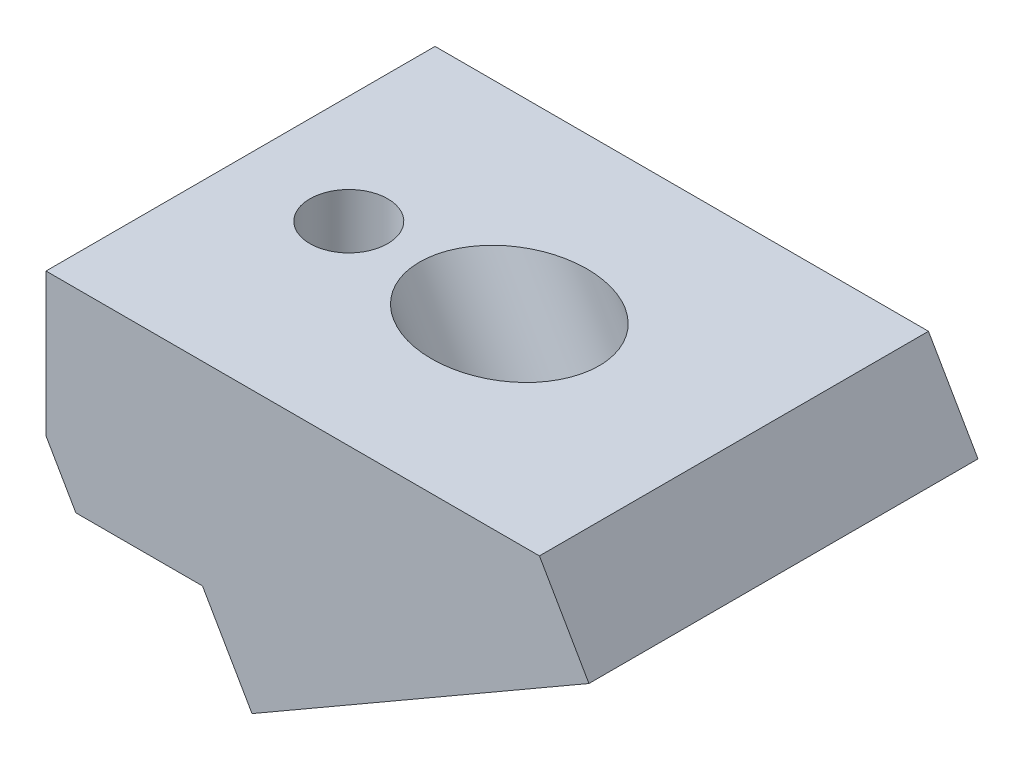
ISO-10303-21;
HEADER;
FILE_DESCRIPTION(('STEP AP214'),'2;1');
FILE_NAME('part.step','',(''),(''),'','','');
FILE_SCHEMA(('AUTOMOTIVE_DESIGN { 1 0 10303 214 1 1 1 1 }'));
ENDSEC;
DATA;
#1=APPLICATION_CONTEXT('core data for automotive mechanical design processes');
#2=APPLICATION_PROTOCOL_DEFINITION('international standard','automotive_design',2000,#1);
#3=PRODUCT_CONTEXT('',#1,'mechanical');
#4=PRODUCT('Part','Part','',(#3));
#5=PRODUCT_RELATED_PRODUCT_CATEGORY('part','',(#4));
#6=PRODUCT_DEFINITION_FORMATION('','',#4);
#7=PRODUCT_DEFINITION_CONTEXT('part definition',#1,'design');
#8=PRODUCT_DEFINITION('design','',#6,#7);
#9=PRODUCT_DEFINITION_SHAPE('','',#8);
#10=(LENGTH_UNIT() NAMED_UNIT(*) SI_UNIT(.MILLI.,.METRE.));
#11=(NAMED_UNIT(*) PLANE_ANGLE_UNIT() SI_UNIT($,.RADIAN.));
#12=(NAMED_UNIT(*) SI_UNIT($,.STERADIAN.) SOLID_ANGLE_UNIT());
#13=UNCERTAINTY_MEASURE_WITH_UNIT(LENGTH_MEASURE(1.E-05),#10,'distance_accuracy_value','');
#14=(GEOMETRIC_REPRESENTATION_CONTEXT(3) GLOBAL_UNCERTAINTY_ASSIGNED_CONTEXT((#13)) GLOBAL_UNIT_ASSIGNED_CONTEXT((#10,
#11,#12)) REPRESENTATION_CONTEXT('',''));
#15=CARTESIAN_POINT('',(0.,0.,0.));
#16=DIRECTION('',(0.,0.,1.));
#17=DIRECTION('',(1.,0.,0.));
#18=AXIS2_PLACEMENT_3D('',#15,#16,#17);
#19=CARTESIAN_POINT('',(-22.8522453423619,18.2415040378444,15.));
#20=DIRECTION('',(-0.866025403784438,-0.500000000000002,0.));
#21=DIRECTION('',(0.500000000000002,-0.866025403784438,0.));
#22=AXIS2_PLACEMENT_3D('',#19,#20,#21);
#23=PLANE('',#22);
#24=DIRECTION('',(0.,0.,-1.));
#25=VECTOR('',#24,1.);
#26=CARTESIAN_POINT('',(-16.8094064186381,7.775,15.));
#27=LINE('',#26,#25);
#28=CARTESIAN_POINT('',(-16.8094064186381,7.775,14.9999999999999));
#29=VERTEX_POINT('',#28);
#30=CARTESIAN_POINT('',(-16.8094064186381,7.775,3.84699737614439));
#31=VERTEX_POINT('',#30);
#32=EDGE_CURVE('E182',#29,#31,#27,.T.);
#33=ORIENTED_EDGE('',*,*,#32,.T.);
#34=CARTESIAN_POINT('',(-20.527350902883,14.2146687464325,0.));
#35=DIRECTION('',(-0.866025403784438,-0.500000000000002,0.));
#36=DIRECTION('',(-0.500000000000002,0.866025403784438,0.));
#37=AXIS2_PLACEMENT_3D('',#34,#35,#36);
#38=ELLIPSE('',#37,10.6999999999978,5.34999999999893);
#39=CARTESIAN_POINT('',(-16.8094064186381,7.775,-3.84699737614439));
#40=VERTEX_POINT('',#39);
#41=EDGE_CURVE('E63',#31,#40,#38,.F.);
#42=ORIENTED_EDGE('',*,*,#41,.T.);
#43=CARTESIAN_POINT('',(-16.8094064186381,7.775,-15.0000000000003));
#44=VERTEX_POINT('',#43);
#45=EDGE_CURVE('E177',#40,#44,#27,.T.);
#46=ORIENTED_EDGE('',*,*,#45,.T.);
#47=DIRECTION('',(0.500000000000002,-0.866025403784438,0.));
#48=VECTOR('',#47,1.);
#49=CARTESIAN_POINT('',(-22.8522453423619,18.2415040378444,-15.));
#50=LINE('',#49,#48);
#51=CARTESIAN_POINT('',(-12.9903810567666,1.16025403784439,-15.));
#52=VERTEX_POINT('',#51);
#53=EDGE_CURVE('E160',#44,#52,#50,.T.);
#54=ORIENTED_EDGE('',*,*,#53,.T.);
#55=DIRECTION('',(0.,0.,-1.));
#56=VECTOR('',#55,1.);
#57=CARTESIAN_POINT('',(-12.9903810567666,1.16025403784439,15.));
#58=LINE('',#57,#56);
#59=CARTESIAN_POINT('',(-12.9903810567666,1.16025403784439,15.));
#60=VERTEX_POINT('',#59);
#61=EDGE_CURVE('E152',#60,#52,#58,.T.);
#62=ORIENTED_EDGE('',*,*,#61,.F.);
#63=DIRECTION('',(0.500000000000002,-0.866025403784438,0.));
#64=VECTOR('',#63,1.);
#65=CARTESIAN_POINT('',(-22.8522453423619,18.2415040378444,15.));
#66=LINE('',#65,#64);
#67=EDGE_CURVE('E162',#29,#60,#66,.T.);
#68=ORIENTED_EDGE('',*,*,#67,.F.);
#69=EDGE_LOOP('',(#33,#42,#46,#54,#62,#68));
#70=FACE_BOUND('',#69,.T.);
#71=ADVANCED_FACE('F42',(#70),#23,.T.);
#72=CARTESIAN_POINT('',(-15.,22.775,-15.));
#73=DIRECTION('',(0.,0.,1.));
#74=DIRECTION('',(1.,0.,0.));
#75=AXIS2_PLACEMENT_3D('',#72,#73,#74);
#76=PLANE('',#75);
#77=DIRECTION('',(-1.,0.,0.));
#78=VECTOR('',#77,1.);
#79=CARTESIAN_POINT('',(-15.4696604564826,7.775,-15.0000000000003));
#80=LINE('',#79,#78);
#81=CARTESIAN_POINT('',(-26.5754872682399,7.775,-15.));
#82=VERTEX_POINT('',#81);
#83=EDGE_CURVE('E118',#44,#82,#80,.T.);
#84=ORIENTED_EDGE('',*,*,#83,.T.);
#85=DIRECTION('',(0.5,-0.866025403784439,0.));
#86=VECTOR('',#85,1.);
#87=CARTESIAN_POINT('',(-38.6554505439858,28.6981101471581,-15.));
#88=LINE('',#87,#86);
#89=CARTESIAN_POINT('',(-28.8773509028816,11.7619447672947,-15.));
#90=VERTEX_POINT('',#89);
#91=EDGE_CURVE('E105',#90,#82,#88,.T.);
#92=ORIENTED_EDGE('',*,*,#91,.F.);
#93=DIRECTION('',(0.,-1.,0.));
#94=VECTOR('',#93,1.);
#95=CARTESIAN_POINT('',(-28.8773509028816,31.275,-15.0000000000003));
#96=LINE('',#95,#94);
#97=CARTESIAN_POINT('',(-28.8773509028816,22.775,-15.0000000000003));
#98=VERTEX_POINT('',#97);
#99=EDGE_CURVE('E114',#98,#90,#96,.T.);
#100=ORIENTED_EDGE('',*,*,#99,.F.);
#101=DIRECTION('',(-1.,0.,0.));
#102=VECTOR('',#101,1.);
#103=CARTESIAN_POINT('',(-15.,22.775,-15.));
#104=LINE('',#103,#102);
#105=CARTESIAN_POINT('',(9.17135569489502,22.775,-15.));
#106=VERTEX_POINT('',#105);
#107=EDGE_CURVE('E171',#106,#98,#104,.T.);
#108=ORIENTED_EDGE('',*,*,#107,.F.);
#109=DIRECTION('',(0.500000000000002,-0.866025403784438,0.));
#110=VECTOR('',#109,1.);
#111=CARTESIAN_POINT('',(3.12851677117123,33.2415040378444,-15.));
#112=LINE('',#111,#110);
#113=CARTESIAN_POINT('',(12.9903810567665,16.1602540378444,-15.));
#114=VERTEX_POINT('',#113);
#115=EDGE_CURVE('E156',#106,#114,#112,.T.);
#116=ORIENTED_EDGE('',*,*,#115,.T.);
#117=DIRECTION('',(-0.866025403784438,-0.500000000000001,0.));
#118=VECTOR('',#117,1.);
#119=CARTESIAN_POINT('',(-15.,0.,-15.));
#120=LINE('',#119,#118);
#121=EDGE_CURVE('E168',#114,#52,#120,.T.);
#122=ORIENTED_EDGE('',*,*,#121,.T.);
#123=ORIENTED_EDGE('',*,*,#53,.F.);
#124=EDGE_LOOP('',(#84,#92,#100,#108,#116,#122,#123));
#125=FACE_BOUND('',#124,.T.);
#126=ADVANCED_FACE('F44',(#125),#76,.F.);
#127=CARTESIAN_POINT('',(-15.,22.775,15.));
#128=DIRECTION('',(0.,0.,-1.));
#129=DIRECTION('',(-1.,0.,0.));
#130=AXIS2_PLACEMENT_3D('',#127,#128,#129);
#131=PLANE('',#130);
#132=DIRECTION('',(0.,-1.,0.));
#133=VECTOR('',#132,1.);
#134=CARTESIAN_POINT('',(-28.8773509028816,31.275,15.));
#135=LINE('',#134,#133);
#136=CARTESIAN_POINT('',(-28.8773509028816,22.775,15.));
#137=VERTEX_POINT('',#136);
#138=CARTESIAN_POINT('',(-28.8773509028816,11.7619447672947,15.));
#139=VERTEX_POINT('',#138);
#140=EDGE_CURVE('E124',#137,#139,#135,.T.);
#141=ORIENTED_EDGE('',*,*,#140,.T.);
#142=DIRECTION('',(-0.5,0.866025403784439,0.));
#143=VECTOR('',#142,1.);
#144=CARTESIAN_POINT('',(-38.6554505439858,28.6981101471581,15.));
#145=LINE('',#144,#143);
#146=CARTESIAN_POINT('',(-26.5754872682399,7.775,15.));
#147=VERTEX_POINT('',#146);
#148=EDGE_CURVE('E57',#147,#139,#145,.T.);
#149=ORIENTED_EDGE('',*,*,#148,.F.);
#150=DIRECTION('',(-1.,0.,0.));
#151=VECTOR('',#150,1.);
#152=CARTESIAN_POINT('',(-15.4696604564825,7.775,14.9999999999998));
#153=LINE('',#152,#151);
#154=EDGE_CURVE('E138',#29,#147,#153,.T.);
#155=ORIENTED_EDGE('',*,*,#154,.F.);
#156=ORIENTED_EDGE('',*,*,#67,.T.);
#157=DIRECTION('',(-0.866025403784438,-0.500000000000001,0.));
#158=VECTOR('',#157,1.);
#159=CARTESIAN_POINT('',(-15.,0.,15.));
#160=LINE('',#159,#158);
#161=CARTESIAN_POINT('',(12.9903810567665,16.1602540378444,15.));
#162=VERTEX_POINT('',#161);
#163=EDGE_CURVE('E167',#162,#60,#160,.T.);
#164=ORIENTED_EDGE('',*,*,#163,.F.);
#165=DIRECTION('',(0.500000000000002,-0.866025403784438,0.));
#166=VECTOR('',#165,1.);
#167=CARTESIAN_POINT('',(3.12851677117123,33.2415040378444,15.));
#168=LINE('',#167,#166);
#169=CARTESIAN_POINT('',(9.17135569489502,22.775,15.));
#170=VERTEX_POINT('',#169);
#171=EDGE_CURVE('E155',#170,#162,#168,.T.);
#172=ORIENTED_EDGE('',*,*,#171,.F.);
#173=DIRECTION('',(1.,0.,0.));
#174=VECTOR('',#173,1.);
#175=CARTESIAN_POINT('',(-15.,22.775,15.));
#176=LINE('',#175,#174);
#177=EDGE_CURVE('E175',#137,#170,#176,.T.);
#178=ORIENTED_EDGE('',*,*,#177,.F.);
#179=EDGE_LOOP('',(#141,#149,#155,#156,#164,#172,#178));
#180=FACE_BOUND('',#179,.T.);
#181=ADVANCED_FACE('F198',(#180),#131,.F.);
#182=CARTESIAN_POINT('',(0.,22.775,0.));
#183=DIRECTION('',(0.,-1.,0.));
#184=DIRECTION('',(0.,0.,-1.));
#185=AXIS2_PLACEMENT_3D('',#182,#183,#184);
#186=PLANE('',#185);
#187=CARTESIAN_POINT('',(-8.14914767260905,22.775,4.07721530149008E-06));
#188=DIRECTION('',(0.,-1.,0.));
#189=DIRECTION('',(1.,0.,0.));
#190=AXIS2_PLACEMENT_3D('',#187,#188,#189);
#191=ELLIPSE('',#190,6.92820323027552,6.);
#192=CARTESIAN_POINT('',(-1.22094444233353,22.775,4.07721530149008E-06));
#193=VERTEX_POINT('',#192);
#194=EDGE_CURVE('E149',#193,#193,#191,.T.);
#195=ORIENTED_EDGE('',*,*,#194,.T.);
#196=EDGE_LOOP('',(#195));
#197=FACE_BOUND('',#196,.T.);
#198=ORIENTED_EDGE('',*,*,#107,.T.);
#199=DIRECTION('',(0.,0.,1.));
#200=VECTOR('',#199,1.);
#201=CARTESIAN_POINT('',(-28.8773509028816,22.775,0.));
#202=LINE('',#201,#200);
#203=EDGE_CURVE('E123',#98,#137,#202,.T.);
#204=ORIENTED_EDGE('',*,*,#203,.T.);
#205=ORIENTED_EDGE('',*,*,#177,.T.);
#206=DIRECTION('',(0.,0.,1.));
#207=VECTOR('',#206,1.);
#208=CARTESIAN_POINT('',(9.17135569489502,22.775,0.));
#209=LINE('',#208,#207);
#210=EDGE_CURVE('E159',#106,#170,#209,.T.);
#211=ORIENTED_EDGE('',*,*,#210,.F.);
#212=EDGE_LOOP('',(#198,#204,#205,#211));
#213=FACE_BOUND('',#212,.T.);
#214=CARTESIAN_POINT('',(-20.527350902883,22.775,0.));
#215=DIRECTION('',(0.,-1.,0.));
#216=DIRECTION('',(0.,0.,-1.));
#217=AXIS2_PLACEMENT_3D('',#214,#215,#216);
#218=CIRCLE('',#217,2.99999999999893);
#219=CARTESIAN_POINT('',(-20.527350902883,22.775,-2.99999999999893));
#220=VERTEX_POINT('',#219);
#221=EDGE_CURVE('E125',#220,#220,#218,.F.);
#222=ORIENTED_EDGE('',*,*,#221,.F.);
#223=EDGE_LOOP('',(#222));
#224=FACE_BOUND('',#223,.T.);
#225=ADVANCED_FACE('F239',(#197,#213,#224),#186,.F.);
#226=CARTESIAN_POINT('',(-15.,0.,-15.));
#227=DIRECTION('',(-0.500000000000001,0.866025403784438,0.));
#228=DIRECTION('',(-0.866025403784438,-0.500000000000001,0.));
#229=AXIS2_PLACEMENT_3D('',#226,#227,#228);
#230=PLANE('',#229);
#231=CARTESIAN_POINT('',(3.53113851526976E-06,8.66025607654819,4.07721530149008E-06));
#232=DIRECTION('',(0.500000000000001,-0.866025403784438,0.));
#233=DIRECTION('',(0.866025403784438,0.500000000000001,0.));
#234=AXIS2_PLACEMENT_3D('',#231,#232,#233);
#235=CIRCLE('',#234,3.95);
#236=CARTESIAN_POINT('',(3.42080387608705,10.6352560765482,4.07721530149008E-06));
#237=VERTEX_POINT('',#236);
#238=EDGE_CURVE('E145',#237,#237,#235,.T.);
#239=ORIENTED_EDGE('',*,*,#238,.F.);
#240=EDGE_LOOP('',(#239));
#241=FACE_BOUND('',#240,.T.);
#242=DIRECTION('',(0.,0.,1.));
#243=VECTOR('',#242,1.);
#244=CARTESIAN_POINT('',(12.9903810567665,16.1602540378444,15.));
#245=LINE('',#244,#243);
#246=EDGE_CURVE('E148',#114,#162,#245,.T.);
#247=ORIENTED_EDGE('',*,*,#246,.T.);
#248=ORIENTED_EDGE('',*,*,#163,.T.);
#249=ORIENTED_EDGE('',*,*,#61,.T.);
#250=ORIENTED_EDGE('',*,*,#121,.F.);
#251=EDGE_LOOP('',(#247,#248,#249,#250));
#252=FACE_BOUND('',#251,.T.);
#253=ADVANCED_FACE('F194',(#241,#252),#230,.F.);
#254=CARTESIAN_POINT('',(3.12851677117123,33.2415040378444,15.));
#255=DIRECTION('',(0.866025403784438,0.500000000000002,0.));
#256=DIRECTION('',(-0.500000000000002,0.866025403784438,0.));
#257=AXIS2_PLACEMENT_3D('',#254,#255,#256);
#258=PLANE('',#257);
#259=ORIENTED_EDGE('',*,*,#210,.T.);
#260=ORIENTED_EDGE('',*,*,#171,.T.);
#261=ORIENTED_EDGE('',*,*,#246,.F.);
#262=ORIENTED_EDGE('',*,*,#115,.F.);
#263=EDGE_LOOP('',(#259,#260,#261,#262));
#264=FACE_BOUND('',#263,.T.);
#265=ADVANCED_FACE('F233',(#264),#258,.T.);
#266=CARTESIAN_POINT('',(-12.4792758685774,30.2750020387038,4.07721530149008E-06));
#267=DIRECTION('',(0.500000000000001,-0.866025403784438,0.));
#268=DIRECTION('',(0.866025403784438,0.500000000000001,0.));
#269=AXIS2_PLACEMENT_3D('',#266,#267,#268);
#270=CYLINDRICAL_SURFACE('',#269,3.95);
#271=CARTESIAN_POINT('',(-3.9999964688615,15.5884593068237,4.07721530149008E-06));
#272=DIRECTION('',(0.500000000000001,-0.866025403784438,0.));
#273=DIRECTION('',(0.866025403784438,0.500000000000001,0.));
#274=AXIS2_PLACEMENT_3D('',#271,#272,#273);
#275=CIRCLE('',#274,3.95);
#276=CARTESIAN_POINT('',(-0.579196123912965,17.5634593068237,4.07721530149008E-06));
#277=VERTEX_POINT('',#276);
#278=EDGE_CURVE('E144',#277,#277,#275,.F.);
#279=ORIENTED_EDGE('',*,*,#278,.T.);
#280=EDGE_LOOP('',(#279));
#281=FACE_BOUND('',#280,.T.);
#282=ORIENTED_EDGE('',*,*,#238,.T.);
#283=EDGE_LOOP('',(#282));
#284=FACE_BOUND('',#283,.T.);
#285=ADVANCED_FACE('F231',(#281,#284),#270,.F.);
#286=CARTESIAN_POINT('',(-16.4999964688615,37.2390944014346,4.07721530149008E-06));
#287=DIRECTION('',(0.500000000000001,-0.866025403784438,0.));
#288=DIRECTION('',(0.866025403784438,0.500000000000001,0.));
#289=AXIS2_PLACEMENT_3D('',#286,#287,#288);
#290=CYLINDRICAL_SURFACE('',#289,6.);
#291=CARTESIAN_POINT('',(-3.9999964688615,15.5884593068237,4.07721530149008E-06));
#292=DIRECTION('',(0.500000000000001,-0.866025403784438,0.));
#293=DIRECTION('',(0.866025403784438,0.500000000000001,0.));
#294=AXIS2_PLACEMENT_3D('',#291,#292,#293);
#295=CIRCLE('',#294,6.);
#296=CARTESIAN_POINT('',(1.19615595384513,18.5884593068237,4.07721530149008E-06));
#297=VERTEX_POINT('',#296);
#298=EDGE_CURVE('E141',#297,#297,#295,.T.);
#299=ORIENTED_EDGE('',*,*,#298,.T.);
#300=EDGE_LOOP('',(#299));
#301=FACE_BOUND('',#300,.T.);
#302=ORIENTED_EDGE('',*,*,#194,.F.);
#303=EDGE_LOOP('',(#302));
#304=FACE_BOUND('',#303,.T.);
#305=ADVANCED_FACE('F313',(#301,#304),#290,.F.);
#306=CARTESIAN_POINT('',(-3.9999964688615,15.5884593068237,4.07721530149008E-06));
#307=DIRECTION('',(0.500000000000001,-0.866025403784438,0.));
#308=DIRECTION('',(0.866025403784438,0.500000000000001,0.));
#309=AXIS2_PLACEMENT_3D('',#306,#307,#308);
#310=PLANE('',#309);
#311=ORIENTED_EDGE('',*,*,#298,.F.);
#312=EDGE_LOOP('',(#311));
#313=FACE_BOUND('',#312,.T.);
#314=ORIENTED_EDGE('',*,*,#278,.F.);
#315=EDGE_LOOP('',(#314));
#316=FACE_BOUND('',#315,.T.);
#317=ADVANCED_FACE('F220',(#313,#316),#310,.F.);
#318=CARTESIAN_POINT('',(-15.4696604564825,7.775,14.9999999999998));
#319=DIRECTION('',(0.,1.,0.));
#320=DIRECTION('',(0.,0.,1.));
#321=AXIS2_PLACEMENT_3D('',#318,#319,#320);
#322=PLANE('',#321);
#323=ORIENTED_EDGE('',*,*,#154,.T.);
#324=DIRECTION('',(0.,0.,-1.));
#325=VECTOR('',#324,1.);
#326=CARTESIAN_POINT('',(-26.5754872682399,7.775,14.9999999999998));
#327=LINE('',#326,#325);
#328=EDGE_CURVE('E119',#147,#82,#327,.T.);
#329=ORIENTED_EDGE('',*,*,#328,.T.);
#330=ORIENTED_EDGE('',*,*,#83,.F.);
#331=ORIENTED_EDGE('',*,*,#45,.F.);
#332=CARTESIAN_POINT('',(-20.527350902883,7.775,0.));
#333=DIRECTION('',(0.,1.,0.));
#334=DIRECTION('',(0.,0.,1.));
#335=AXIS2_PLACEMENT_3D('',#332,#333,#334);
#336=CIRCLE('',#335,5.34999999999893);
#337=EDGE_CURVE('E50',#31,#40,#336,.F.);
#338=ORIENTED_EDGE('',*,*,#337,.F.);
#339=ORIENTED_EDGE('',*,*,#32,.F.);
#340=EDGE_LOOP('',(#323,#329,#330,#331,#338,#339));
#341=FACE_BOUND('',#340,.T.);
#342=ADVANCED_FACE('F190',(#341),#322,.F.);
#343=CARTESIAN_POINT('',(-20.527350902883,11.275,0.));
#344=DIRECTION('',(0.,-1.,0.));
#345=DIRECTION('',(0.,0.,-1.));
#346=AXIS2_PLACEMENT_3D('',#343,#344,#345);
#347=PLANE('',#346);
#348=CARTESIAN_POINT('',(-20.527350902883,11.275,0.));
#349=DIRECTION('',(0.,-1.,0.));
#350=DIRECTION('',(0.,0.,-1.));
#351=AXIS2_PLACEMENT_3D('',#348,#349,#350);
#352=CIRCLE('',#351,5.34999999999893);
#353=CARTESIAN_POINT('',(-20.527350902883,11.275,-5.34999999999893));
#354=VERTEX_POINT('',#353);
#355=EDGE_CURVE('E133',#354,#354,#352,.T.);
#356=ORIENTED_EDGE('',*,*,#355,.T.);
#357=EDGE_LOOP('',(#356));
#358=FACE_BOUND('',#357,.T.);
#359=CARTESIAN_POINT('',(-20.527350902883,11.275,0.));
#360=DIRECTION('',(0.,-1.,0.));
#361=DIRECTION('',(0.,0.,-1.));
#362=AXIS2_PLACEMENT_3D('',#359,#360,#361);
#363=CIRCLE('',#362,2.99999999999893);
#364=CARTESIAN_POINT('',(-20.527350902883,11.275,-2.99999999999893));
#365=VERTEX_POINT('',#364);
#366=EDGE_CURVE('E129',#365,#365,#363,.T.);
#367=ORIENTED_EDGE('',*,*,#366,.F.);
#368=EDGE_LOOP('',(#367));
#369=FACE_BOUND('',#368,.T.);
#370=ADVANCED_FACE('F209',(#358,#369),#347,.T.);
#371=CARTESIAN_POINT('',(-20.527350902883,-2.225,0.));
#372=DIRECTION('',(0.,1.,0.));
#373=DIRECTION('',(0.,0.,1.));
#374=AXIS2_PLACEMENT_3D('',#371,#372,#373);
#375=CYLINDRICAL_SURFACE('',#374,5.34999999999893);
#376=ORIENTED_EDGE('',*,*,#337,.T.);
#377=ORIENTED_EDGE('',*,*,#41,.F.);
#378=EDGE_LOOP('',(#376,#377));
#379=FACE_BOUND('',#378,.T.);
#380=ORIENTED_EDGE('',*,*,#355,.F.);
#381=EDGE_LOOP('',(#380));
#382=FACE_BOUND('',#381,.T.);
#383=ADVANCED_FACE('F184',(#379,#382),#375,.F.);
#384=CARTESIAN_POINT('',(-28.8773509028816,31.275,15.));
#385=DIRECTION('',(1.,0.,0.));
#386=DIRECTION('',(0.,0.,-1.));
#387=AXIS2_PLACEMENT_3D('',#384,#385,#386);
#388=PLANE('',#387);
#389=ORIENTED_EDGE('',*,*,#99,.T.);
#390=DIRECTION('',(0.,0.,1.));
#391=VECTOR('',#390,1.);
#392=CARTESIAN_POINT('',(-28.8773509028816,11.7619447672947,15.));
#393=LINE('',#392,#391);
#394=EDGE_CURVE('E13',#90,#139,#393,.T.);
#395=ORIENTED_EDGE('',*,*,#394,.T.);
#396=ORIENTED_EDGE('',*,*,#140,.F.);
#397=ORIENTED_EDGE('',*,*,#203,.F.);
#398=EDGE_LOOP('',(#389,#395,#396,#397));
#399=FACE_BOUND('',#398,.T.);
#400=ADVANCED_FACE('F121',(#399),#388,.F.);
#401=CARTESIAN_POINT('',(-20.527350902883,33.9472871427445,0.));
#402=DIRECTION('',(0.,-1.,0.));
#403=DIRECTION('',(0.,0.,-1.));
#404=AXIS2_PLACEMENT_3D('',#401,#402,#403);
#405=CYLINDRICAL_SURFACE('',#404,2.99999999999893);
#406=ORIENTED_EDGE('',*,*,#221,.T.);
#407=EDGE_LOOP('',(#406));
#408=FACE_BOUND('',#407,.T.);
#409=ORIENTED_EDGE('',*,*,#366,.T.);
#410=EDGE_LOOP('',(#409));
#411=FACE_BOUND('',#410,.T.);
#412=ADVANCED_FACE('F207',(#408,#411),#405,.F.);
#413=CARTESIAN_POINT('',(-38.6554505439858,28.6981101471581,-46.4661772628743));
#414=DIRECTION('',(0.866025403784438,0.5,0.));
#415=DIRECTION('',(-0.5,0.866025403784439,0.));
#416=AXIS2_PLACEMENT_3D('',#413,#414,#415);
#417=PLANE('',#416);
#418=ORIENTED_EDGE('',*,*,#148,.T.);
#419=ORIENTED_EDGE('',*,*,#394,.F.);
#420=ORIENTED_EDGE('',*,*,#91,.T.);
#421=ORIENTED_EDGE('',*,*,#328,.F.);
#422=EDGE_LOOP('',(#418,#419,#420,#421));
#423=FACE_BOUND('',#422,.T.);
#424=ADVANCED_FACE('F104',(#423),#417,.F.);
#425=CLOSED_SHELL('',(#71,#126,#181,#225,#253,#265,#285,#305,#317,#342,#370,#383,#400,#412,#424));
#426=MANIFOLD_SOLID_BREP('B2',#425);
#427=ADVANCED_BREP_SHAPE_REPRESENTATION('',(#18,#426),#14);
#428=SHAPE_DEFINITION_REPRESENTATION(#9,#427);
ENDSEC;
END-ISO-10303-21;
